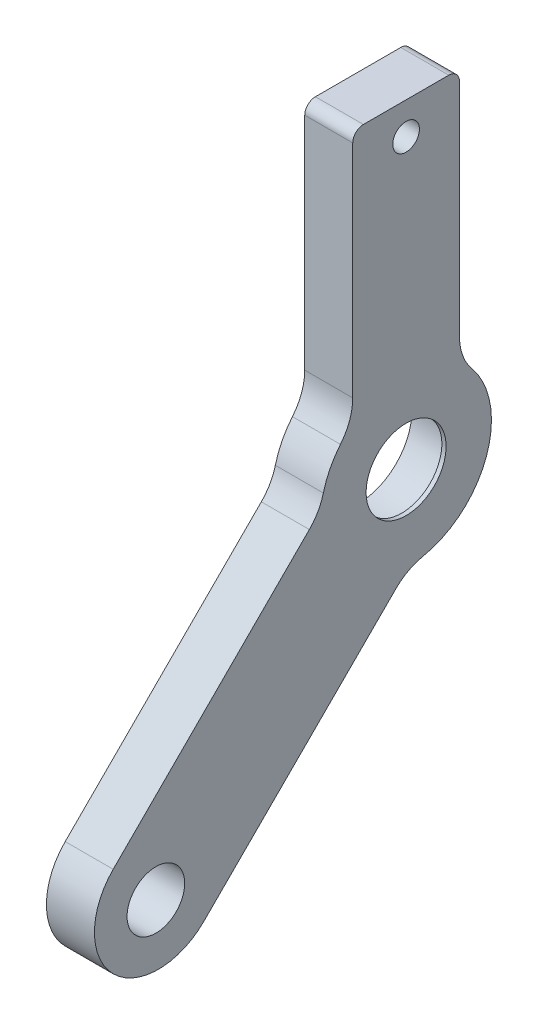
ISO-10303-21;
HEADER;
FILE_DESCRIPTION(('STEP AP214'),'2;1');
FILE_NAME('part.step','',(''),(''),'','','');
FILE_SCHEMA(('AUTOMOTIVE_DESIGN { 1 0 10303 214 1 1 1 1 }'));
ENDSEC;
DATA;
#1=APPLICATION_CONTEXT('core data for automotive mechanical design processes');
#2=APPLICATION_PROTOCOL_DEFINITION('international standard','automotive_design',2000,#1);
#3=PRODUCT_CONTEXT('',#1,'mechanical');
#4=PRODUCT('Part','Part','',(#3));
#5=PRODUCT_RELATED_PRODUCT_CATEGORY('part','',(#4));
#6=PRODUCT_DEFINITION_FORMATION('','',#4);
#7=PRODUCT_DEFINITION_CONTEXT('part definition',#1,'design');
#8=PRODUCT_DEFINITION('design','',#6,#7);
#9=PRODUCT_DEFINITION_SHAPE('','',#8);
#10=(LENGTH_UNIT() NAMED_UNIT(*) SI_UNIT(.MILLI.,.METRE.));
#11=(NAMED_UNIT(*) PLANE_ANGLE_UNIT() SI_UNIT($,.RADIAN.));
#12=(NAMED_UNIT(*) SI_UNIT($,.STERADIAN.) SOLID_ANGLE_UNIT());
#13=UNCERTAINTY_MEASURE_WITH_UNIT(LENGTH_MEASURE(1.E-05),#10,'distance_accuracy_value','');
#14=(GEOMETRIC_REPRESENTATION_CONTEXT(3) GLOBAL_UNCERTAINTY_ASSIGNED_CONTEXT((#13)) GLOBAL_UNIT_ASSIGNED_CONTEXT((#10,
#11,#12)) REPRESENTATION_CONTEXT('',''));
#15=CARTESIAN_POINT('',(0.,0.,0.));
#16=DIRECTION('',(0.,0.,1.));
#17=DIRECTION('',(1.,0.,0.));
#18=AXIS2_PLACEMENT_3D('',#15,#16,#17);
#19=CARTESIAN_POINT('',(-2.75,0.,0.));
#20=DIRECTION('',(1.,0.,0.));
#21=DIRECTION('',(0.,0.,-1.));
#22=AXIS2_PLACEMENT_3D('',#19,#20,#21);
#23=CYLINDRICAL_SURFACE('',#22,3.75);
#24=CARTESIAN_POINT('',(2.25,0.,0.));
#25=DIRECTION('',(-1.,0.,0.));
#26=DIRECTION('',(0.,0.,1.));
#27=AXIS2_PLACEMENT_3D('',#24,#25,#26);
#28=CIRCLE('',#27,3.75);
#29=CARTESIAN_POINT('',(2.25,0.,3.75));
#30=VERTEX_POINT('',#29);
#31=EDGE_CURVE('E311',#30,#30,#28,.T.);
#32=ORIENTED_EDGE('',*,*,#31,.F.);
#33=EDGE_LOOP('',(#32));
#34=FACE_BOUND('',#33,.T.);
#35=CARTESIAN_POINT('',(1.85,0.,0.));
#36=DIRECTION('',(-1.,0.,0.));
#37=DIRECTION('',(0.,0.,1.));
#38=AXIS2_PLACEMENT_3D('',#35,#36,#37);
#39=CIRCLE('',#38,3.75);
#40=CARTESIAN_POINT('',(1.85,0.,3.75));
#41=VERTEX_POINT('',#40);
#42=EDGE_CURVE('E38',#41,#41,#39,.T.);
#43=ORIENTED_EDGE('',*,*,#42,.T.);
#44=EDGE_LOOP('',(#43));
#45=FACE_BOUND('',#44,.T.);
#46=ADVANCED_FACE('F34',(#34,#45),#23,.F.);
#47=CARTESIAN_POINT('',(-2.25,-22.9735992364267,23.2093014968222));
#48=DIRECTION('',(1.,0.,0.));
#49=DIRECTION('',(0.,0.,-1.));
#50=AXIS2_PLACEMENT_3D('',#47,#48,#49);
#51=PLANE('',#50);
#52=CARTESIAN_POINT('',(-2.25,27.,0.));
#53=DIRECTION('',(1.,0.,0.));
#54=DIRECTION('',(0.,0.,-1.));
#55=AXIS2_PLACEMENT_3D('',#52,#53,#54);
#56=CIRCLE('',#55,1.25);
#57=CARTESIAN_POINT('',(-2.25,27.,-1.25));
#58=VERTEX_POINT('',#57);
#59=EDGE_CURVE('E329',#58,#58,#56,.T.);
#60=ORIENTED_EDGE('',*,*,#59,.T.);
#61=EDGE_LOOP('',(#60));
#62=FACE_BOUND('',#61,.T.);
#63=CARTESIAN_POINT('',(-2.25,0.,0.));
#64=DIRECTION('',(-1.,0.,0.));
#65=DIRECTION('',(0.,0.,1.));
#66=AXIS2_PLACEMENT_3D('',#63,#64,#65);
#67=CIRCLE('',#66,5.05);
#68=CARTESIAN_POINT('',(-2.25,0.,5.05));
#69=VERTEX_POINT('',#68);
#70=EDGE_CURVE('E320',#69,#69,#67,.T.);
#71=ORIENTED_EDGE('',*,*,#70,.F.);
#72=EDGE_LOOP('',(#71));
#73=FACE_BOUND('',#72,.T.);
#74=CARTESIAN_POINT('',(-2.25,-22.9735992364267,23.2093014968222));
#75=DIRECTION('',(-1.,0.,0.));
#76=DIRECTION('',(0.,0.,-1.));
#77=AXIS2_PLACEMENT_3D('',#74,#75,#76);
#78=CIRCLE('',#77,6.);
#79=CARTESIAN_POINT('',(-2.25,-27.216239923546,18.9666608097029));
#80=VERTEX_POINT('',#79);
#81=CARTESIAN_POINT('',(-2.25,-18.7309585493074,27.4519421839415));
#82=VERTEX_POINT('',#81);
#83=EDGE_CURVE('E196',#80,#82,#78,.T.);
#84=ORIENTED_EDGE('',*,*,#83,.T.);
#85=DIRECTION('',(0.,0.707106781186548,-0.707106781186548));
#86=VECTOR('',#85,1.);
#87=CARTESIAN_POINT('',(-2.25,-0.346181931497273,9.06716556613136));
#88=LINE('',#87,#86);
#89=CARTESIAN_POINT('',(-2.25,-0.346181931497273,9.06716556613136));
#90=VERTEX_POINT('',#89);
#91=EDGE_CURVE('E113',#82,#90,#88,.T.);
#92=ORIENTED_EDGE('',*,*,#91,.T.);
#93=CARTESIAN_POINT('',(-2.25,3.18935197443546,12.6026994720641));
#94=DIRECTION('',(1.,0.,0.));
#95=DIRECTION('',(0.,0.,-1.));
#96=AXIS2_PLACEMENT_3D('',#93,#94,#95);
#97=CIRCLE('',#96,5.);
#98=CARTESIAN_POINT('',(-2.25,1.96267813811413,7.75550736742406));
#99=VERTEX_POINT('',#98);
#100=EDGE_CURVE('E230',#90,#99,#97,.T.);
#101=ORIENTED_EDGE('',*,*,#100,.T.);
#102=CARTESIAN_POINT('',(-2.25,0.,0.));
#103=DIRECTION('',(-1.,0.,0.));
#104=DIRECTION('',(0.,0.,1.));
#105=AXIS2_PLACEMENT_3D('',#102,#103,#104);
#106=CIRCLE('',#105,8.);
#107=CARTESIAN_POINT('',(-2.25,5.11176853102651,6.15384615384616));
#108=VERTEX_POINT('',#107);
#109=EDGE_CURVE('E249',#99,#108,#106,.T.);
#110=ORIENTED_EDGE('',*,*,#109,.T.);
#111=CARTESIAN_POINT('',(-2.25,8.30662386291807,10.));
#112=DIRECTION('',(1.,0.,0.));
#113=DIRECTION('',(0.,0.,1.));
#114=AXIS2_PLACEMENT_3D('',#111,#112,#113);
#115=CIRCLE('',#114,5.);
#116=CARTESIAN_POINT('',(-2.25,8.30662386291807,5.));
#117=VERTEX_POINT('',#116);
#118=EDGE_CURVE('E246',#108,#117,#115,.T.);
#119=ORIENTED_EDGE('',*,*,#118,.T.);
#120=DIRECTION('',(0.,1.,0.));
#121=VECTOR('',#120,1.);
#122=CARTESIAN_POINT('',(-2.25,8.30662386291807,5.));
#123=LINE('',#122,#121);
#124=CARTESIAN_POINT('',(-2.25,29.,5.));
#125=VERTEX_POINT('',#124);
#126=EDGE_CURVE('E248',#117,#125,#123,.T.);
#127=ORIENTED_EDGE('',*,*,#126,.T.);
#128=CARTESIAN_POINT('',(-2.25,29.,4.));
#129=DIRECTION('',(-1.,0.,0.));
#130=DIRECTION('',(0.,0.,1.));
#131=AXIS2_PLACEMENT_3D('',#128,#129,#130);
#132=CIRCLE('',#131,0.999999999999999);
#133=CARTESIAN_POINT('',(-2.25,30.,4.));
#134=VERTEX_POINT('',#133);
#135=EDGE_CURVE('E251',#125,#134,#132,.T.);
#136=ORIENTED_EDGE('',*,*,#135,.T.);
#137=DIRECTION('',(0.,0.,-1.));
#138=VECTOR('',#137,1.);
#139=CARTESIAN_POINT('',(-2.25,30.,-4.));
#140=LINE('',#139,#138);
#141=CARTESIAN_POINT('',(-2.25,30.,-4.));
#142=VERTEX_POINT('',#141);
#143=EDGE_CURVE('E257',#134,#142,#140,.T.);
#144=ORIENTED_EDGE('',*,*,#143,.T.);
#145=CARTESIAN_POINT('',(-2.25,29.,-4.));
#146=DIRECTION('',(-1.,0.,0.));
#147=DIRECTION('',(0.,0.,-1.));
#148=AXIS2_PLACEMENT_3D('',#145,#146,#147);
#149=CIRCLE('',#148,0.999999999999999);
#150=CARTESIAN_POINT('',(-2.25,29.,-5.));
#151=VERTEX_POINT('',#150);
#152=EDGE_CURVE('E259',#142,#151,#149,.T.);
#153=ORIENTED_EDGE('',*,*,#152,.T.);
#154=DIRECTION('',(0.,-1.,0.));
#155=VECTOR('',#154,1.);
#156=CARTESIAN_POINT('',(-2.25,8.30662386291807,-5.));
#157=LINE('',#156,#155);
#158=CARTESIAN_POINT('',(-2.25,8.30662386291807,-5.));
#159=VERTEX_POINT('',#158);
#160=EDGE_CURVE('E261',#151,#159,#157,.T.);
#161=ORIENTED_EDGE('',*,*,#160,.T.);
#162=CARTESIAN_POINT('',(-2.25,8.30662386291807,-10.));
#163=DIRECTION('',(1.,0.,0.));
#164=DIRECTION('',(0.,0.,-1.));
#165=AXIS2_PLACEMENT_3D('',#162,#163,#164);
#166=CIRCLE('',#165,5.);
#167=CARTESIAN_POINT('',(-2.25,5.11176853102651,-6.15384615384615));
#168=VERTEX_POINT('',#167);
#169=EDGE_CURVE('E151',#159,#168,#166,.T.);
#170=ORIENTED_EDGE('',*,*,#169,.T.);
#171=CARTESIAN_POINT('',(-2.25,0.,0.));
#172=DIRECTION('',(-1.,0.,0.));
#173=DIRECTION('',(0.,0.,1.));
#174=AXIS2_PLACEMENT_3D('',#171,#172,#173);
#175=CIRCLE('',#174,8.);
#176=CARTESIAN_POINT('',(-2.25,-7.8409890477926,-1.58710136802803));
#177=VERTEX_POINT('',#176);
#178=EDGE_CURVE('E144',#168,#177,#175,.T.);
#179=ORIENTED_EDGE('',*,*,#178,.T.);
#180=CARTESIAN_POINT('',(-2.25,-12.741607202663,-2.57903972304555));
#181=DIRECTION('',(1.,0.,0.));
#182=DIRECTION('',(0.,0.,1.));
#183=AXIS2_PLACEMENT_3D('',#180,#181,#182);
#184=CIRCLE('',#183,5.);
#185=CARTESIAN_POINT('',(-2.25,-9.20607329673024,0.956494182887188));
#186=VERTEX_POINT('',#185);
#187=EDGE_CURVE('E149',#177,#186,#184,.T.);
#188=ORIENTED_EDGE('',*,*,#187,.T.);
#189=DIRECTION('',(0.,-0.707106781186547,0.707106781186548));
#190=VECTOR('',#189,1.);
#191=CARTESIAN_POINT('',(-2.25,-9.20607329673024,0.956494182887187));
#192=LINE('',#191,#190);
#193=EDGE_CURVE('E52',#186,#80,#192,.T.);
#194=ORIENTED_EDGE('',*,*,#193,.T.);
#195=EDGE_LOOP('',(#84,#92,#101,#110,#119,#127,#136,#144,#153,#161,#170,#179,#188,#194));
#196=FACE_BOUND('',#195,.T.);
#197=CARTESIAN_POINT('',(-2.25,-23.2163750431964,23.4520773035919));
#198=DIRECTION('',(-1.,0.,0.));
#199=DIRECTION('',(0.,0.,1.));
#200=AXIS2_PLACEMENT_3D('',#197,#198,#199);
#201=CIRCLE('',#200,2.7);
#202=CARTESIAN_POINT('',(-2.25,-23.2163750431964,26.1520773035919));
#203=VERTEX_POINT('',#202);
#204=EDGE_CURVE('E173',#203,#203,#201,.T.);
#205=ORIENTED_EDGE('',*,*,#204,.F.);
#206=EDGE_LOOP('',(#205));
#207=FACE_BOUND('',#206,.T.);
#208=ADVANCED_FACE('F146',(#62,#73,#196,#207),#51,.F.);
#209=CARTESIAN_POINT('',(2.25,-22.9735992364267,23.2093014968222));
#210=DIRECTION('',(1.,0.,0.));
#211=DIRECTION('',(0.,0.,-1.));
#212=AXIS2_PLACEMENT_3D('',#209,#210,#211);
#213=PLANE('',#212);
#214=CARTESIAN_POINT('',(2.25,27.,0.));
#215=DIRECTION('',(1.,0.,0.));
#216=DIRECTION('',(0.,0.,-1.));
#217=AXIS2_PLACEMENT_3D('',#214,#215,#216);
#218=CIRCLE('',#217,1.25);
#219=CARTESIAN_POINT('',(2.25,27.,-1.25));
#220=VERTEX_POINT('',#219);
#221=EDGE_CURVE('E309',#220,#220,#218,.T.);
#222=ORIENTED_EDGE('',*,*,#221,.F.);
#223=EDGE_LOOP('',(#222));
#224=FACE_BOUND('',#223,.T.);
#225=ORIENTED_EDGE('',*,*,#31,.T.);
#226=EDGE_LOOP('',(#225));
#227=FACE_BOUND('',#226,.T.);
#228=CARTESIAN_POINT('',(2.25,-22.9735992364267,23.2093014968222));
#229=DIRECTION('',(-1.,0.,0.));
#230=DIRECTION('',(0.,0.,-1.));
#231=AXIS2_PLACEMENT_3D('',#228,#229,#230);
#232=CIRCLE('',#231,6.);
#233=CARTESIAN_POINT('',(2.25,-27.216239923546,18.9666608097029));
#234=VERTEX_POINT('',#233);
#235=CARTESIAN_POINT('',(2.25,-18.7309585493074,27.4519421839415));
#236=VERTEX_POINT('',#235);
#237=EDGE_CURVE('E169',#234,#236,#232,.T.);
#238=ORIENTED_EDGE('',*,*,#237,.F.);
#239=DIRECTION('',(0.,-0.707106781186547,0.707106781186548));
#240=VECTOR('',#239,1.);
#241=CARTESIAN_POINT('',(2.25,-9.20607329673024,0.956494182887187));
#242=LINE('',#241,#240);
#243=CARTESIAN_POINT('',(2.25,-9.20607329673024,0.956494182887188));
#244=VERTEX_POINT('',#243);
#245=EDGE_CURVE('E105',#244,#234,#242,.T.);
#246=ORIENTED_EDGE('',*,*,#245,.F.);
#247=CARTESIAN_POINT('',(2.25,-12.741607202663,-2.57903972304555));
#248=DIRECTION('',(1.,0.,0.));
#249=DIRECTION('',(0.,0.,1.));
#250=AXIS2_PLACEMENT_3D('',#247,#248,#249);
#251=CIRCLE('',#250,5.);
#252=CARTESIAN_POINT('',(2.25,-7.8409890477926,-1.58710136802803));
#253=VERTEX_POINT('',#252);
#254=EDGE_CURVE('E99',#253,#244,#251,.T.);
#255=ORIENTED_EDGE('',*,*,#254,.F.);
#256=CARTESIAN_POINT('',(2.25,0.,0.));
#257=DIRECTION('',(-1.,0.,0.));
#258=DIRECTION('',(0.,0.,1.));
#259=AXIS2_PLACEMENT_3D('',#256,#257,#258);
#260=CIRCLE('',#259,8.);
#261=CARTESIAN_POINT('',(2.25,5.11176853102651,-6.15384615384615));
#262=VERTEX_POINT('',#261);
#263=EDGE_CURVE('E159',#262,#253,#260,.T.);
#264=ORIENTED_EDGE('',*,*,#263,.F.);
#265=CARTESIAN_POINT('',(2.25,8.30662386291807,-10.));
#266=DIRECTION('',(1.,0.,0.));
#267=DIRECTION('',(0.,0.,-1.));
#268=AXIS2_PLACEMENT_3D('',#265,#266,#267);
#269=CIRCLE('',#268,5.);
#270=CARTESIAN_POINT('',(2.25,8.30662386291807,-5.));
#271=VERTEX_POINT('',#270);
#272=EDGE_CURVE('E191',#271,#262,#269,.T.);
#273=ORIENTED_EDGE('',*,*,#272,.F.);
#274=DIRECTION('',(0.,-1.,0.));
#275=VECTOR('',#274,1.);
#276=CARTESIAN_POINT('',(2.25,8.30662386291807,-5.));
#277=LINE('',#276,#275);
#278=CARTESIAN_POINT('',(2.25,29.,-5.));
#279=VERTEX_POINT('',#278);
#280=EDGE_CURVE('E189',#279,#271,#277,.T.);
#281=ORIENTED_EDGE('',*,*,#280,.F.);
#282=CARTESIAN_POINT('',(2.25,29.,-4.));
#283=DIRECTION('',(-1.,0.,0.));
#284=DIRECTION('',(0.,0.,-1.));
#285=AXIS2_PLACEMENT_3D('',#282,#283,#284);
#286=CIRCLE('',#285,0.999999999999999);
#287=CARTESIAN_POINT('',(2.25,30.,-4.));
#288=VERTEX_POINT('',#287);
#289=EDGE_CURVE('E187',#288,#279,#286,.T.);
#290=ORIENTED_EDGE('',*,*,#289,.F.);
#291=DIRECTION('',(0.,0.,-1.));
#292=VECTOR('',#291,1.);
#293=CARTESIAN_POINT('',(2.25,30.,-4.));
#294=LINE('',#293,#292);
#295=CARTESIAN_POINT('',(2.25,30.,4.));
#296=VERTEX_POINT('',#295);
#297=EDGE_CURVE('E185',#296,#288,#294,.T.);
#298=ORIENTED_EDGE('',*,*,#297,.F.);
#299=CARTESIAN_POINT('',(2.25,29.,4.));
#300=DIRECTION('',(-1.,0.,0.));
#301=DIRECTION('',(0.,0.,1.));
#302=AXIS2_PLACEMENT_3D('',#299,#300,#301);
#303=CIRCLE('',#302,0.999999999999999);
#304=CARTESIAN_POINT('',(2.25,29.,5.));
#305=VERTEX_POINT('',#304);
#306=EDGE_CURVE('E183',#305,#296,#303,.T.);
#307=ORIENTED_EDGE('',*,*,#306,.F.);
#308=DIRECTION('',(0.,1.,0.));
#309=VECTOR('',#308,1.);
#310=CARTESIAN_POINT('',(2.25,8.30662386291807,5.));
#311=LINE('',#310,#309);
#312=CARTESIAN_POINT('',(2.25,8.30662386291807,5.));
#313=VERTEX_POINT('',#312);
#314=EDGE_CURVE('E181',#313,#305,#311,.T.);
#315=ORIENTED_EDGE('',*,*,#314,.F.);
#316=CARTESIAN_POINT('',(2.25,8.30662386291807,10.));
#317=DIRECTION('',(1.,0.,0.));
#318=DIRECTION('',(0.,0.,1.));
#319=AXIS2_PLACEMENT_3D('',#316,#317,#318);
#320=CIRCLE('',#319,5.);
#321=CARTESIAN_POINT('',(2.25,5.11176853102651,6.15384615384616));
#322=VERTEX_POINT('',#321);
#323=EDGE_CURVE('E179',#322,#313,#320,.T.);
#324=ORIENTED_EDGE('',*,*,#323,.F.);
#325=CARTESIAN_POINT('',(2.25,0.,0.));
#326=DIRECTION('',(-1.,0.,0.));
#327=DIRECTION('',(0.,0.,1.));
#328=AXIS2_PLACEMENT_3D('',#325,#326,#327);
#329=CIRCLE('',#328,8.);
#330=CARTESIAN_POINT('',(2.25,1.96267813811413,7.75550736742406));
#331=VERTEX_POINT('',#330);
#332=EDGE_CURVE('E177',#331,#322,#329,.T.);
#333=ORIENTED_EDGE('',*,*,#332,.F.);
#334=CARTESIAN_POINT('',(2.25,3.18935197443546,12.6026994720641));
#335=DIRECTION('',(1.,0.,0.));
#336=DIRECTION('',(0.,0.,-1.));
#337=AXIS2_PLACEMENT_3D('',#334,#335,#336);
#338=CIRCLE('',#337,5.);
#339=CARTESIAN_POINT('',(2.25,-0.346181931497273,9.06716556613136));
#340=VERTEX_POINT('',#339);
#341=EDGE_CURVE('E175',#340,#331,#338,.T.);
#342=ORIENTED_EDGE('',*,*,#341,.F.);
#343=DIRECTION('',(0.,0.707106781186548,-0.707106781186548));
#344=VECTOR('',#343,1.);
#345=CARTESIAN_POINT('',(2.25,-0.346181931497273,9.06716556613136));
#346=LINE('',#345,#344);
#347=EDGE_CURVE('E172',#236,#340,#346,.T.);
#348=ORIENTED_EDGE('',*,*,#347,.F.);
#349=EDGE_LOOP('',(#238,#246,#255,#264,#273,#281,#290,#298,#307,#315,#324,#333,#342,#348));
#350=FACE_BOUND('',#349,.T.);
#351=CARTESIAN_POINT('',(2.25,-23.2163750431964,23.4520773035919));
#352=DIRECTION('',(-1.,0.,0.));
#353=DIRECTION('',(0.,0.,1.));
#354=AXIS2_PLACEMENT_3D('',#351,#352,#353);
#355=CIRCLE('',#354,2.7);
#356=CARTESIAN_POINT('',(2.25,-23.2163750431964,26.1520773035919));
#357=VERTEX_POINT('',#356);
#358=EDGE_CURVE('E312',#357,#357,#355,.T.);
#359=ORIENTED_EDGE('',*,*,#358,.T.);
#360=EDGE_LOOP('',(#359));
#361=FACE_BOUND('',#360,.T.);
#362=ADVANCED_FACE('F234',(#224,#227,#350,#361),#213,.T.);
#363=CARTESIAN_POINT('',(-2.25,-22.9735992364267,23.2093014968222));
#364=DIRECTION('',(1.,0.,0.));
#365=DIRECTION('',(0.,0.,-1.));
#366=AXIS2_PLACEMENT_3D('',#363,#364,#365);
#367=CYLINDRICAL_SURFACE('',#366,6.);
#368=ORIENTED_EDGE('',*,*,#237,.T.);
#369=DIRECTION('',(1.,0.,0.));
#370=VECTOR('',#369,1.);
#371=CARTESIAN_POINT('',(-2.25,-18.7309585493074,27.4519421839415));
#372=LINE('',#371,#370);
#373=EDGE_CURVE('E11',#82,#236,#372,.T.);
#374=ORIENTED_EDGE('',*,*,#373,.F.);
#375=ORIENTED_EDGE('',*,*,#83,.F.);
#376=DIRECTION('',(1.,0.,0.));
#377=VECTOR('',#376,1.);
#378=CARTESIAN_POINT('',(-2.25,-27.216239923546,18.9666608097029));
#379=LINE('',#378,#377);
#380=EDGE_CURVE('E165',#80,#234,#379,.T.);
#381=ORIENTED_EDGE('',*,*,#380,.T.);
#382=EDGE_LOOP('',(#368,#374,#375,#381));
#383=FACE_BOUND('',#382,.T.);
#384=ADVANCED_FACE('F36',(#383),#367,.T.);
#385=CARTESIAN_POINT('',(-2.25,-0.346181931497273,9.06716556613136));
#386=DIRECTION('',(0.,-0.707106781186547,-0.707106781186547));
#387=DIRECTION('',(0.,0.707106781186548,-0.707106781186548));
#388=AXIS2_PLACEMENT_3D('',#385,#386,#387);
#389=PLANE('',#388);
#390=ORIENTED_EDGE('',*,*,#347,.T.);
#391=DIRECTION('',(1.,0.,0.));
#392=VECTOR('',#391,1.);
#393=CARTESIAN_POINT('',(-2.25,-0.346181931497273,9.06716556613136));
#394=LINE('',#393,#392);
#395=EDGE_CURVE('E44',#90,#340,#394,.T.);
#396=ORIENTED_EDGE('',*,*,#395,.F.);
#397=ORIENTED_EDGE('',*,*,#91,.F.);
#398=ORIENTED_EDGE('',*,*,#373,.T.);
#399=EDGE_LOOP('',(#390,#396,#397,#398));
#400=FACE_BOUND('',#399,.T.);
#401=ADVANCED_FACE('F305',(#400),#389,.F.);
#402=CARTESIAN_POINT('',(-2.25,3.18935197443546,12.6026994720641));
#403=DIRECTION('',(1.,0.,0.));
#404=DIRECTION('',(0.,0.,-1.));
#405=AXIS2_PLACEMENT_3D('',#402,#403,#404);
#406=CYLINDRICAL_SURFACE('',#405,5.);
#407=ORIENTED_EDGE('',*,*,#341,.T.);
#408=DIRECTION('',(1.,0.,0.));
#409=VECTOR('',#408,1.);
#410=CARTESIAN_POINT('',(-2.25,1.96267813811413,7.75550736742406));
#411=LINE('',#410,#409);
#412=EDGE_CURVE('E221',#99,#331,#411,.T.);
#413=ORIENTED_EDGE('',*,*,#412,.F.);
#414=ORIENTED_EDGE('',*,*,#100,.F.);
#415=ORIENTED_EDGE('',*,*,#395,.T.);
#416=EDGE_LOOP('',(#407,#413,#414,#415));
#417=FACE_BOUND('',#416,.T.);
#418=ADVANCED_FACE('F228',(#417),#406,.F.);
#419=CARTESIAN_POINT('',(-2.25,0.,0.));
#420=DIRECTION('',(1.,0.,0.));
#421=DIRECTION('',(0.,0.,-1.));
#422=AXIS2_PLACEMENT_3D('',#419,#420,#421);
#423=CYLINDRICAL_SURFACE('',#422,8.);
#424=ORIENTED_EDGE('',*,*,#332,.T.);
#425=DIRECTION('',(1.,0.,0.));
#426=VECTOR('',#425,1.);
#427=CARTESIAN_POINT('',(-2.25,5.11176853102651,6.15384615384616));
#428=LINE('',#427,#426);
#429=EDGE_CURVE('E218',#108,#322,#428,.T.);
#430=ORIENTED_EDGE('',*,*,#429,.F.);
#431=ORIENTED_EDGE('',*,*,#109,.F.);
#432=ORIENTED_EDGE('',*,*,#412,.T.);
#433=EDGE_LOOP('',(#424,#430,#431,#432));
#434=FACE_BOUND('',#433,.T.);
#435=ADVANCED_FACE('F240',(#434),#423,.T.);
#436=CARTESIAN_POINT('',(-2.25,8.30662386291807,10.));
#437=DIRECTION('',(1.,0.,0.));
#438=DIRECTION('',(0.,0.,-1.));
#439=AXIS2_PLACEMENT_3D('',#436,#437,#438);
#440=CYLINDRICAL_SURFACE('',#439,5.);
#441=ORIENTED_EDGE('',*,*,#323,.T.);
#442=DIRECTION('',(1.,0.,0.));
#443=VECTOR('',#442,1.);
#444=CARTESIAN_POINT('',(-2.25,8.30662386291807,5.));
#445=LINE('',#444,#443);
#446=EDGE_CURVE('E215',#117,#313,#445,.T.);
#447=ORIENTED_EDGE('',*,*,#446,.F.);
#448=ORIENTED_EDGE('',*,*,#118,.F.);
#449=ORIENTED_EDGE('',*,*,#429,.T.);
#450=EDGE_LOOP('',(#441,#447,#448,#449));
#451=FACE_BOUND('',#450,.T.);
#452=ADVANCED_FACE('F244',(#451),#440,.F.);
#453=CARTESIAN_POINT('',(-2.25,8.30662386291807,5.));
#454=DIRECTION('',(0.,0.,-1.));
#455=DIRECTION('',(-1.,0.,0.));
#456=AXIS2_PLACEMENT_3D('',#453,#454,#455);
#457=PLANE('',#456);
#458=ORIENTED_EDGE('',*,*,#314,.T.);
#459=DIRECTION('',(1.,0.,0.));
#460=VECTOR('',#459,1.);
#461=CARTESIAN_POINT('',(-2.25,29.,5.));
#462=LINE('',#461,#460);
#463=EDGE_CURVE('E212',#125,#305,#462,.T.);
#464=ORIENTED_EDGE('',*,*,#463,.F.);
#465=ORIENTED_EDGE('',*,*,#126,.F.);
#466=ORIENTED_EDGE('',*,*,#446,.T.);
#467=EDGE_LOOP('',(#458,#464,#465,#466));
#468=FACE_BOUND('',#467,.T.);
#469=ADVANCED_FACE('F404',(#468),#457,.F.);
#470=CARTESIAN_POINT('',(-2.25,29.,4.));
#471=DIRECTION('',(1.,0.,0.));
#472=DIRECTION('',(0.,0.,-1.));
#473=AXIS2_PLACEMENT_3D('',#470,#471,#472);
#474=CYLINDRICAL_SURFACE('',#473,0.999999999999999);
#475=ORIENTED_EDGE('',*,*,#306,.T.);
#476=DIRECTION('',(1.,0.,0.));
#477=VECTOR('',#476,1.);
#478=CARTESIAN_POINT('',(-2.25,30.,4.));
#479=LINE('',#478,#477);
#480=EDGE_CURVE('E209',#134,#296,#479,.T.);
#481=ORIENTED_EDGE('',*,*,#480,.F.);
#482=ORIENTED_EDGE('',*,*,#135,.F.);
#483=ORIENTED_EDGE('',*,*,#463,.T.);
#484=EDGE_LOOP('',(#475,#481,#482,#483));
#485=FACE_BOUND('',#484,.T.);
#486=ADVANCED_FACE('F412',(#485),#474,.T.);
#487=CARTESIAN_POINT('',(-2.25,30.,-4.));
#488=DIRECTION('',(0.,-1.,0.));
#489=DIRECTION('',(0.,0.,-1.));
#490=AXIS2_PLACEMENT_3D('',#487,#488,#489);
#491=PLANE('',#490);
#492=ORIENTED_EDGE('',*,*,#297,.T.);
#493=DIRECTION('',(1.,0.,0.));
#494=VECTOR('',#493,1.);
#495=CARTESIAN_POINT('',(-2.25,30.,-4.));
#496=LINE('',#495,#494);
#497=EDGE_CURVE('E206',#142,#288,#496,.T.);
#498=ORIENTED_EDGE('',*,*,#497,.F.);
#499=ORIENTED_EDGE('',*,*,#143,.F.);
#500=ORIENTED_EDGE('',*,*,#480,.T.);
#501=EDGE_LOOP('',(#492,#498,#499,#500));
#502=FACE_BOUND('',#501,.T.);
#503=ADVANCED_FACE('F421',(#502),#491,.F.);
#504=CARTESIAN_POINT('',(-2.25,29.,-4.));
#505=DIRECTION('',(1.,0.,0.));
#506=DIRECTION('',(0.,0.,-1.));
#507=AXIS2_PLACEMENT_3D('',#504,#505,#506);
#508=CYLINDRICAL_SURFACE('',#507,0.999999999999999);
#509=ORIENTED_EDGE('',*,*,#289,.T.);
#510=DIRECTION('',(1.,0.,0.));
#511=VECTOR('',#510,1.);
#512=CARTESIAN_POINT('',(-2.25,29.,-5.));
#513=LINE('',#512,#511);
#514=EDGE_CURVE('E203',#151,#279,#513,.T.);
#515=ORIENTED_EDGE('',*,*,#514,.F.);
#516=ORIENTED_EDGE('',*,*,#152,.F.);
#517=ORIENTED_EDGE('',*,*,#497,.T.);
#518=EDGE_LOOP('',(#509,#515,#516,#517));
#519=FACE_BOUND('',#518,.T.);
#520=ADVANCED_FACE('F430',(#519),#508,.T.);
#521=CARTESIAN_POINT('',(-2.25,8.30662386291807,-5.));
#522=DIRECTION('',(0.,0.,1.));
#523=DIRECTION('',(1.,0.,0.));
#524=AXIS2_PLACEMENT_3D('',#521,#522,#523);
#525=PLANE('',#524);
#526=ORIENTED_EDGE('',*,*,#280,.T.);
#527=DIRECTION('',(1.,0.,0.));
#528=VECTOR('',#527,1.);
#529=CARTESIAN_POINT('',(-2.25,8.30662386291807,-5.));
#530=LINE('',#529,#528);
#531=EDGE_CURVE('E200',#159,#271,#530,.T.);
#532=ORIENTED_EDGE('',*,*,#531,.F.);
#533=ORIENTED_EDGE('',*,*,#160,.F.);
#534=ORIENTED_EDGE('',*,*,#514,.T.);
#535=EDGE_LOOP('',(#526,#532,#533,#534));
#536=FACE_BOUND('',#535,.T.);
#537=ADVANCED_FACE('F267',(#536),#525,.F.);
#538=CARTESIAN_POINT('',(-2.25,8.30662386291807,-10.));
#539=DIRECTION('',(1.,0.,0.));
#540=DIRECTION('',(0.,0.,-1.));
#541=AXIS2_PLACEMENT_3D('',#538,#539,#540);
#542=CYLINDRICAL_SURFACE('',#541,5.);
#543=ORIENTED_EDGE('',*,*,#272,.T.);
#544=DIRECTION('',(1.,0.,0.));
#545=VECTOR('',#544,1.);
#546=CARTESIAN_POINT('',(-2.25,5.11176853102651,-6.15384615384615));
#547=LINE('',#546,#545);
#548=EDGE_CURVE('E160',#168,#262,#547,.T.);
#549=ORIENTED_EDGE('',*,*,#548,.F.);
#550=ORIENTED_EDGE('',*,*,#169,.F.);
#551=ORIENTED_EDGE('',*,*,#531,.T.);
#552=EDGE_LOOP('',(#543,#549,#550,#551));
#553=FACE_BOUND('',#552,.T.);
#554=ADVANCED_FACE('F271',(#553),#542,.F.);
#555=CARTESIAN_POINT('',(-2.25,0.,0.));
#556=DIRECTION('',(1.,0.,0.));
#557=DIRECTION('',(0.,0.,-1.));
#558=AXIS2_PLACEMENT_3D('',#555,#556,#557);
#559=CYLINDRICAL_SURFACE('',#558,8.);
#560=ORIENTED_EDGE('',*,*,#263,.T.);
#561=DIRECTION('',(1.,0.,0.));
#562=VECTOR('',#561,1.);
#563=CARTESIAN_POINT('',(-2.25,-7.8409890477926,-1.58710136802803));
#564=LINE('',#563,#562);
#565=EDGE_CURVE('E156',#177,#253,#564,.T.);
#566=ORIENTED_EDGE('',*,*,#565,.F.);
#567=ORIENTED_EDGE('',*,*,#178,.F.);
#568=ORIENTED_EDGE('',*,*,#548,.T.);
#569=EDGE_LOOP('',(#560,#566,#567,#568));
#570=FACE_BOUND('',#569,.T.);
#571=ADVANCED_FACE('F157',(#570),#559,.T.);
#572=CARTESIAN_POINT('',(-2.25,-12.741607202663,-2.57903972304555));
#573=DIRECTION('',(1.,0.,0.));
#574=DIRECTION('',(0.,0.,-1.));
#575=AXIS2_PLACEMENT_3D('',#572,#573,#574);
#576=CYLINDRICAL_SURFACE('',#575,5.);
#577=ORIENTED_EDGE('',*,*,#254,.T.);
#578=DIRECTION('',(1.,0.,0.));
#579=VECTOR('',#578,1.);
#580=CARTESIAN_POINT('',(-2.25,-9.20607329673024,0.956494182887188));
#581=LINE('',#580,#579);
#582=EDGE_CURVE('E161',#186,#244,#581,.T.);
#583=ORIENTED_EDGE('',*,*,#582,.F.);
#584=ORIENTED_EDGE('',*,*,#187,.F.);
#585=ORIENTED_EDGE('',*,*,#565,.T.);
#586=EDGE_LOOP('',(#577,#583,#584,#585));
#587=FACE_BOUND('',#586,.T.);
#588=ADVANCED_FACE('F163',(#587),#576,.F.);
#589=CARTESIAN_POINT('',(-2.25,-9.20607329673024,0.956494182887187));
#590=DIRECTION('',(0.,0.707106781186548,0.707106781186547));
#591=DIRECTION('',(0.,-0.707106781186547,0.707106781186548));
#592=AXIS2_PLACEMENT_3D('',#589,#590,#591);
#593=PLANE('',#592);
#594=ORIENTED_EDGE('',*,*,#245,.T.);
#595=ORIENTED_EDGE('',*,*,#380,.F.);
#596=ORIENTED_EDGE('',*,*,#193,.F.);
#597=ORIENTED_EDGE('',*,*,#582,.T.);
#598=EDGE_LOOP('',(#594,#595,#596,#597));
#599=FACE_BOUND('',#598,.T.);
#600=ADVANCED_FACE('F275',(#599),#593,.F.);
#601=CARTESIAN_POINT('',(-2.25,-23.2163750431964,23.4520773035919));
#602=DIRECTION('',(1.,0.,0.));
#603=DIRECTION('',(0.,0.,-1.));
#604=AXIS2_PLACEMENT_3D('',#601,#602,#603);
#605=CYLINDRICAL_SURFACE('',#604,2.7);
#606=ORIENTED_EDGE('',*,*,#204,.T.);
#607=EDGE_LOOP('',(#606));
#608=FACE_BOUND('',#607,.T.);
#609=ORIENTED_EDGE('',*,*,#358,.F.);
#610=EDGE_LOOP('',(#609));
#611=FACE_BOUND('',#610,.T.);
#612=ADVANCED_FACE('F277',(#608,#611),#605,.F.);
#613=CARTESIAN_POINT('',(1.85,0.,0.));
#614=DIRECTION('',(-1.,0.,0.));
#615=DIRECTION('',(0.,0.,1.));
#616=AXIS2_PLACEMENT_3D('',#613,#614,#615);
#617=CYLINDRICAL_SURFACE('',#616,5.05);
#618=CARTESIAN_POINT('',(1.85,0.,0.));
#619=DIRECTION('',(-1.,0.,0.));
#620=DIRECTION('',(0.,0.,1.));
#621=AXIS2_PLACEMENT_3D('',#618,#619,#620);
#622=CIRCLE('',#621,5.05);
#623=CARTESIAN_POINT('',(1.85,0.,5.05));
#624=VERTEX_POINT('',#623);
#625=EDGE_CURVE('E317',#624,#624,#622,.T.);
#626=ORIENTED_EDGE('',*,*,#625,.F.);
#627=EDGE_LOOP('',(#626));
#628=FACE_BOUND('',#627,.T.);
#629=ORIENTED_EDGE('',*,*,#70,.T.);
#630=EDGE_LOOP('',(#629));
#631=FACE_BOUND('',#630,.T.);
#632=ADVANCED_FACE('F283',(#628,#631),#617,.F.);
#633=CARTESIAN_POINT('',(1.85,0.,0.));
#634=DIRECTION('',(-1.,0.,0.));
#635=DIRECTION('',(0.,0.,1.));
#636=AXIS2_PLACEMENT_3D('',#633,#634,#635);
#637=PLANE('',#636);
#638=ORIENTED_EDGE('',*,*,#42,.F.);
#639=EDGE_LOOP('',(#638));
#640=FACE_BOUND('',#639,.T.);
#641=ORIENTED_EDGE('',*,*,#625,.T.);
#642=EDGE_LOOP('',(#641));
#643=FACE_BOUND('',#642,.T.);
#644=ADVANCED_FACE('F338',(#640,#643),#637,.T.);
#645=CARTESIAN_POINT('',(-3.75,27.,0.));
#646=DIRECTION('',(1.,0.,0.));
#647=DIRECTION('',(0.,0.,-1.));
#648=AXIS2_PLACEMENT_3D('',#645,#646,#647);
#649=CYLINDRICAL_SURFACE('',#648,1.25);
#650=ORIENTED_EDGE('',*,*,#221,.T.);
#651=EDGE_LOOP('',(#650));
#652=FACE_BOUND('',#651,.T.);
#653=ORIENTED_EDGE('',*,*,#59,.F.);
#654=EDGE_LOOP('',(#653));
#655=FACE_BOUND('',#654,.T.);
#656=ADVANCED_FACE('F335',(#652,#655),#649,.F.);
#657=CLOSED_SHELL('',(#46,#208,#362,#384,#401,#418,#435,#452,#469,#486,#503,#520,#537,#554,#571,
#588,#600,#612,#632,#644,#656));
#658=MANIFOLD_SOLID_BREP('B2',#657);
#659=ADVANCED_BREP_SHAPE_REPRESENTATION('',(#18,#658),#14);
#660=SHAPE_DEFINITION_REPRESENTATION(#9,#659);
ENDSEC;
END-ISO-10303-21;
